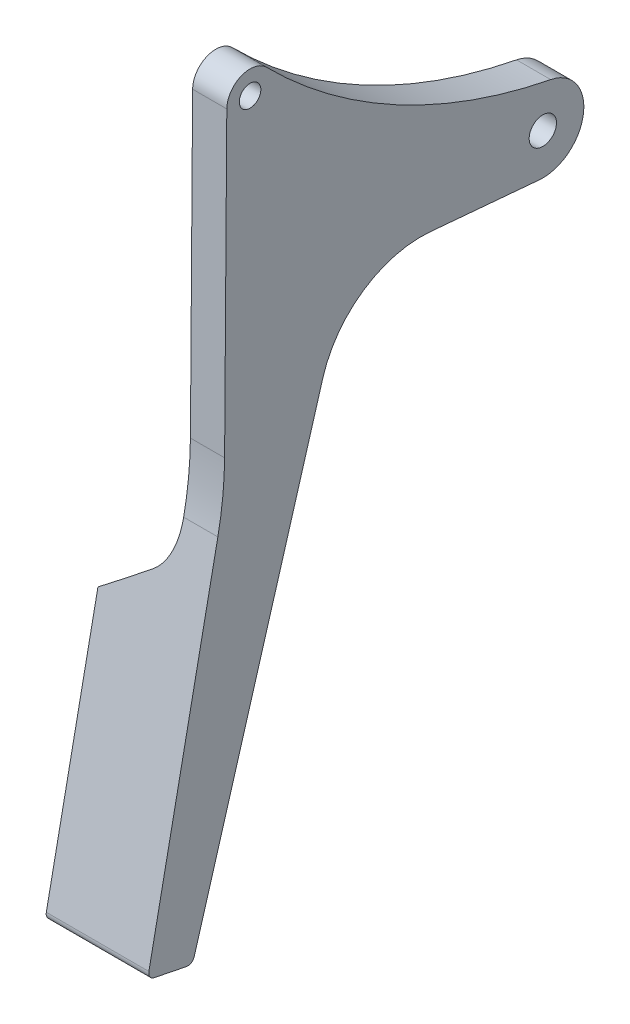
ISO-10303-21;
HEADER;
FILE_DESCRIPTION(('STEP AP214'),'2;1');
FILE_NAME('part.step','',(''),(''),'','','');
FILE_SCHEMA(('AUTOMOTIVE_DESIGN { 1 0 10303 214 1 1 1 1 }'));
ENDSEC;
DATA;
#1=APPLICATION_CONTEXT('core data for automotive mechanical design processes');
#2=APPLICATION_PROTOCOL_DEFINITION('international standard','automotive_design',2000,#1);
#3=PRODUCT_CONTEXT('',#1,'mechanical');
#4=PRODUCT('Part','Part','',(#3));
#5=PRODUCT_RELATED_PRODUCT_CATEGORY('part','',(#4));
#6=PRODUCT_DEFINITION_FORMATION('','',#4);
#7=PRODUCT_DEFINITION_CONTEXT('part definition',#1,'design');
#8=PRODUCT_DEFINITION('design','',#6,#7);
#9=PRODUCT_DEFINITION_SHAPE('','',#8);
#10=(LENGTH_UNIT() NAMED_UNIT(*) SI_UNIT(.MILLI.,.METRE.));
#11=(NAMED_UNIT(*) PLANE_ANGLE_UNIT() SI_UNIT($,.RADIAN.));
#12=(NAMED_UNIT(*) SI_UNIT($,.STERADIAN.) SOLID_ANGLE_UNIT());
#13=UNCERTAINTY_MEASURE_WITH_UNIT(LENGTH_MEASURE(1.E-05),#10,'distance_accuracy_value','');
#14=(GEOMETRIC_REPRESENTATION_CONTEXT(3) GLOBAL_UNCERTAINTY_ASSIGNED_CONTEXT((#13)) GLOBAL_UNIT_ASSIGNED_CONTEXT((#10,
#11,#12)) REPRESENTATION_CONTEXT('',''));
#15=CARTESIAN_POINT('',(0.,0.,0.));
#16=DIRECTION('',(0.,0.,1.));
#17=DIRECTION('',(1.,0.,0.));
#18=AXIS2_PLACEMENT_3D('',#15,#16,#17);
#19=CARTESIAN_POINT('',(158.962030866419,-137.598340552411,-33.4938597849691));
#20=DIRECTION('',(0.,0.282459573012157,0.959279203159221));
#21=DIRECTION('',(0.,-0.959279203159221,0.282459573012157));
#22=AXIS2_PLACEMENT_3D('',#19,#20,#21);
#23=PLANE('',#22);
#24=DIRECTION('',(0.,0.959279203159221,-0.282459573012157));
#25=VECTOR('',#24,1.);
#26=CARTESIAN_POINT('',(20.,-137.598340552411,-33.4938597849691));
#27=LINE('',#26,#25);
#28=CARTESIAN_POINT('',(20.,-129.015775162978,-36.0209944786688));
#29=VERTEX_POINT('',#28);
#30=CARTESIAN_POINT('',(20.,-65.1850920027316,-54.8159266018088));
#31=VERTEX_POINT('',#30);
#32=EDGE_CURVE('E293',#29,#31,#27,.T.);
#33=ORIENTED_EDGE('',*,*,#32,.F.);
#34=DIRECTION('',(1.,0.,0.));
#35=VECTOR('',#34,1.);
#36=CARTESIAN_POINT('',(158.962030866419,-129.015775162978,-36.0209944786688));
#37=LINE('',#36,#35);
#38=CARTESIAN_POINT('',(5.,-129.015775162978,-36.0209944786688));
#39=VERTEX_POINT('',#38);
#40=EDGE_CURVE('E60',#29,#39,#37,.F.);
#41=ORIENTED_EDGE('',*,*,#40,.T.);
#42=DIRECTION('',(0.,-0.959279203159221,0.282459573012157));
#43=VECTOR('',#42,1.);
#44=CARTESIAN_POINT('',(5.,-137.598340552411,-33.4938597849691));
#45=LINE('',#44,#43);
#46=CARTESIAN_POINT('',(5.,-98.5136821411292,-45.0023297797516));
#47=VERTEX_POINT('',#46);
#48=EDGE_CURVE('E167',#47,#39,#45,.T.);
#49=ORIENTED_EDGE('',*,*,#48,.F.);
#50=CARTESIAN_POINT('',(12.0002,-94.225863053771,-46.2648772680948));
#51=CARTESIAN_POINT('',(11.4181068308902,-94.5851016538781,-46.1590995328311));
#52=CARTESIAN_POINT('',(10.8356698756042,-94.9438274183706,-46.0534728019135));
#53=CARTESIAN_POINT('',(9.67014830951818,-95.6603061476602,-45.8425057807575));
#54=CARTESIAN_POINT('',(9.08706370047362,-96.0180591150849,-45.7371654897454));
#55=CARTESIAN_POINT('',(7.92028374249992,-96.7326469738212,-45.5267552350525));
#56=CARTESIAN_POINT('',(7.33658839372461,-97.0894818653638,-45.4216852713037));
#57=CARTESIAN_POINT('',(6.16861919214037,-97.8022827331318,-45.2118011957505));
#58=CARTESIAN_POINT('',(5.58434533777172,-98.1582487070053,-45.1069870846387));
#59=CARTESIAN_POINT('',(4.9998,-98.5138037927106,-45.0022939594673));
#60=B_SPLINE_CURVE_WITH_KNOTS('',3,(#50,#51,#52,#53,#54,#55,#56,#57,#58,#59),.UNSPECIFIED.,.F.,
.F.,(4,2,2,2,4),(0.,2.07645415499275,4.152902695728,6.22935071360871,8.30580434521774),.UNSPECIFIED.);
#61=CARTESIAN_POINT('',(12.,-94.2259864840353,-46.2648409240777));
#62=VERTEX_POINT('',#61);
#63=EDGE_CURVE('E166',#62,#47,#60,.T.);
#64=ORIENTED_EDGE('',*,*,#63,.F.);
#65=CARTESIAN_POINT('',(11.9998,-82.8210578346822,-49.6230199254791));
#66=CARTESIAN_POINT('',(12.15430459384,-82.9221876774031,-49.5932422631472));
#67=CARTESIAN_POINT('',(12.303724032,-83.030324075716,-49.561401521897));
#68=CARTESIAN_POINT('',(12.5916230267251,-83.2590322603663,-49.4940584418344));
#69=CARTESIAN_POINT('',(12.7301123642273,-83.3795927008879,-49.4585594437953));
#70=CARTESIAN_POINT('',(12.9950068854421,-83.6311360505902,-49.384492553867));
#71=CARTESIAN_POINT('',(13.1214684519462,-83.7620644583574,-49.3459407099082));
#72=CARTESIAN_POINT('',(13.3626681740416,-84.0334950336313,-49.2660180303152));
#73=CARTESIAN_POINT('',(13.4774036194469,-84.1739994019192,-49.2246465466614));
#74=CARTESIAN_POINT('',(13.8026889570887,-84.60689301851,-49.0971811062564));
#75=CARTESIAN_POINT('',(13.9954861067135,-84.9117891156579,-49.0074045103188));
#76=CARTESIAN_POINT('',(14.3317274927634,-85.5458893614363,-48.8206938174574));
#77=CARTESIAN_POINT('',(14.4750960285437,-85.8751298656586,-48.7237490156367));
#78=CARTESIAN_POINT('',(14.7251350926013,-86.5897429817325,-48.5133313239257));
#79=CARTESIAN_POINT('',(14.8254868876638,-86.9771572482292,-48.399257269226));
#80=CARTESIAN_POINT('',(14.961497245702,-87.7624621172597,-48.1680244047375));
#81=CARTESIAN_POINT('',(14.9971464855845,-88.1603542211831,-48.0508651528649));
#82=CARTESIAN_POINT('',(15.0012683437187,-88.7698981527664,-47.8713850618964));
#83=CARTESIAN_POINT('',(14.9933598944176,-88.9816268012067,-47.8090416029369));
#84=CARTESIAN_POINT('',(14.9587197840348,-89.4036396209142,-47.6847800110378));
#85=CARTESIAN_POINT('',(14.9319951131521,-89.6139242993296,-47.6228617287686));
#86=CARTESIAN_POINT('',(14.8595574177556,-90.0316438936498,-47.4998642762419));
#87=CARTESIAN_POINT('',(14.8138282604547,-90.2390762332947,-47.4387858645635));
#88=CARTESIAN_POINT('',(14.7033319592601,-90.6491316046192,-47.3180451409929));
#89=CARTESIAN_POINT('',(14.6385742356532,-90.8517569625283,-47.2583821441428));
#90=CARTESIAN_POINT('',(14.492228621175,-91.2445952089229,-47.1427109996271));
#91=CARTESIAN_POINT('',(14.4111953921699,-91.4349979692104,-47.0866469442468));
#92=CARTESIAN_POINT('',(14.2313903087825,-91.8078339793632,-46.9768654542651));
#93=CARTESIAN_POINT('',(14.1326275235328,-91.9902712447471,-46.9231468372951));
#94=CARTESIAN_POINT('',(13.9178017475281,-92.3451254816741,-46.8186600769089));
#95=CARTESIAN_POINT('',(13.801769529992,-92.5175595338758,-46.7678869040962));
#96=CARTESIAN_POINT('',(13.5528576994898,-92.850725171158,-46.6697863476167));
#97=CARTESIAN_POINT('',(13.419984167748,-93.0114609475479,-46.6224577298198));
#98=CARTESIAN_POINT('',(13.0925465783273,-93.3689692269932,-46.5171894871352));
#99=CARTESIAN_POINT('',(12.8918870754706,-93.5607023301862,-46.4607337125476));
#100=CARTESIAN_POINT('',(12.5715619087451,-93.8269340822958,-46.3823418254145));
#101=CARTESIAN_POINT('',(12.4614347543216,-93.9121971920322,-46.3572361194944));
#102=CARTESIAN_POINT('',(12.23508612833,-94.0750508991275,-46.3092838774171));
#103=CARTESIAN_POINT('',(12.1188612988083,-94.1526371995843,-46.2864386064819));
#104=CARTESIAN_POINT('',(11.9998,-94.2261099087566,-46.2648045816928));
#105=B_SPLINE_CURVE_WITH_KNOTS('',3,(#65,#66,#67,#68,#69,#70,#71,#72,#73,#74,#75,#76,#77,#78,
#79,#80,#81,#82,#83,#84,#85,#86,#87,#88,#89,#90,#91,#92,#93,#94,#95,#96,#97,#98,#99,#100,#101,
#102,#103,#104),.UNSPECIFIED.,.F.,.F.,(4,2,2,2,2,2,2,2,2,2,2,2,2,2,2,2,2,2,2,4),(0.,
0.56079926032494,1.12109085421803,1.67861111933887,2.2362599506535,3.3466462182285,
4.45872558202947,5.70190580097859,6.94526513750978,7.60716196303557,8.26881302450779,
8.93102690835336,9.59291350717973,10.2352162455361,10.8771913605936,11.5180359108483,
12.1586497145137,13.0053273599257,13.4295837325269,13.8540762444164),.UNSPECIFIED.);
#106=CARTESIAN_POINT('',(15.,-88.6066840713936,-47.9194434161089));
#107=VERTEX_POINT('',#106);
#108=EDGE_CURVE('E159',#107,#62,#105,.T.);
#109=ORIENTED_EDGE('',*,*,#108,.F.);
#110=DIRECTION('',(0.,-0.959279203159221,0.282459573012157));
#111=VECTOR('',#110,1.);
#112=CARTESIAN_POINT('',(15.,-53.4033261892142,-58.285065232205));
#113=LINE('',#112,#111);
#114=CARTESIAN_POINT('',(15.,-65.1850920027316,-54.8159266018088));
#115=VERTEX_POINT('',#114);
#116=EDGE_CURVE('E144',#115,#107,#113,.T.);
#117=ORIENTED_EDGE('',*,*,#116,.F.);
#118=DIRECTION('',(-1.,0.,0.));
#119=VECTOR('',#118,1.);
#120=CARTESIAN_POINT('',(20.,-65.1850920027316,-54.8159266018088));
#121=LINE('',#120,#119);
#122=EDGE_CURVE('E262',#115,#31,#121,.F.);
#123=ORIENTED_EDGE('',*,*,#122,.T.);
#124=EDGE_LOOP('',(#33,#41,#49,#64,#109,#117,#123));
#125=FACE_BOUND('',#124,.T.);
#126=ADVANCED_FACE('F37',(#125),#23,.F.);
#127=CARTESIAN_POINT('',(158.962030866419,-77.5968625232369,-39.4790610609905));
#128=DIRECTION('',(0.,-0.197778037606252,-0.98024683005895));
#129=DIRECTION('',(0.,0.98024683005895,-0.197778037606252));
#130=AXIS2_PLACEMENT_3D('',#127,#128,#129);
#131=PLANE('',#130);
#132=DIRECTION('',(0.,0.98024683005895,-0.197778037606252));
#133=VECTOR('',#132,1.);
#134=CARTESIAN_POINT('',(5.,-77.5968625232369,-39.4790610609905));
#135=LINE('',#134,#133);
#136=CARTESIAN_POINT('',(5.,-127.589450856243,-29.3923811430716));
#137=VERTEX_POINT('',#136);
#138=CARTESIAN_POINT('',(5.,-90.1654034922796,-36.9431881642819));
#139=VERTEX_POINT('',#138);
#140=EDGE_CURVE('E258',#137,#139,#135,.T.);
#141=ORIENTED_EDGE('',*,*,#140,.F.);
#142=DIRECTION('',(1.,0.,0.));
#143=VECTOR('',#142,1.);
#144=CARTESIAN_POINT('',(158.962030866419,-127.589450856243,-29.3923811430716));
#145=LINE('',#144,#143);
#146=CARTESIAN_POINT('',(20.,-127.589450856243,-29.3923811430716));
#147=VERTEX_POINT('',#146);
#148=EDGE_CURVE('E11',#137,#147,#145,.T.);
#149=ORIENTED_EDGE('',*,*,#148,.T.);
#150=DIRECTION('',(0.,-0.98024683005895,0.197778037606252));
#151=VECTOR('',#150,1.);
#152=CARTESIAN_POINT('',(20.,-77.5968625232369,-39.4790610609905));
#153=LINE('',#152,#151);
#154=CARTESIAN_POINT('',(20.,-77.5968625232369,-39.4790610609905));
#155=VERTEX_POINT('',#154);
#156=EDGE_CURVE('E295',#155,#147,#153,.T.);
#157=ORIENTED_EDGE('',*,*,#156,.F.);
#158=DIRECTION('',(-1.,0.,0.));
#159=VECTOR('',#158,1.);
#160=CARTESIAN_POINT('',(158.962030866419,-77.5968625232369,-39.4790610609905));
#161=LINE('',#160,#159);
#162=CARTESIAN_POINT('',(15.,-77.5968625232369,-39.4790610609905));
#163=VERTEX_POINT('',#162);
#164=EDGE_CURVE('E322',#155,#163,#161,.T.);
#165=ORIENTED_EDGE('',*,*,#164,.T.);
#166=CARTESIAN_POINT('',(10.0477170206096,-85.8341572682851,-37.8170755896761));
#167=CARTESIAN_POINT('',(10.1760522091918,-85.8039492038567,-37.8231704746778));
#168=CARTESIAN_POINT('',(10.3030103733954,-85.7682730305671,-37.830368624497));
#169=CARTESIAN_POINT('',(10.553397225375,-85.6866517194451,-37.8468368264289));
#170=CARTESIAN_POINT('',(10.6768272053135,-85.6407103969125,-37.8561061087535));
#171=CARTESIAN_POINT('',(10.918746861634,-85.5395087522913,-37.8765249074294));
#172=CARTESIAN_POINT('',(11.0372618436195,-85.4843063045308,-37.8876627468535));
#173=CARTESIAN_POINT('',(11.2695707323867,-85.3651344788264,-37.9117072722761));
#174=CARTESIAN_POINT('',(11.3833657099646,-85.3011671036521,-37.9246135541888));
#175=CARTESIAN_POINT('',(11.582039449859,-85.1797562665324,-37.9491098304055));
#176=CARTESIAN_POINT('',(11.6678978297567,-85.1238430771922,-37.9603910715428));
#177=CARTESIAN_POINT('',(11.8363378370368,-85.0074069244855,-37.9838836379889));
#178=CARTESIAN_POINT('',(11.9189181405588,-84.9468821269442,-37.9960953333673));
#179=CARTESIAN_POINT('',(12.1557311415426,-84.7634391736108,-38.033107426863));
#180=CARTESIAN_POINT('',(12.3053495894116,-84.6347373607704,-38.0590747559064));
#181=CARTESIAN_POINT('',(12.5915139579439,-84.363942774374,-38.1137112211818));
#182=CARTESIAN_POINT('',(12.7280480498831,-84.2218381101582,-38.142382756515));
#183=CARTESIAN_POINT('',(12.9883861964154,-83.9259255029901,-38.2020871217361));
#184=CARTESIAN_POINT('',(13.112140809486,-83.7720758383059,-38.2331283695469));
#185=CARTESIAN_POINT('',(13.3464743161514,-83.4551611820793,-38.2970701818284));
#186=CARTESIAN_POINT('',(13.4570549563716,-83.2920974163923,-38.3299704989662));
#187=CARTESIAN_POINT('',(13.830480835454,-82.6940033740638,-38.4506440501254));
#188=CARTESIAN_POINT('',(14.05743411425,-82.2368525081984,-38.542880411793));
#189=CARTESIAN_POINT('',(14.3394346890461,-81.5303117591492,-38.6854345507616));
#190=CARTESIAN_POINT('',(14.4237214994715,-81.2912164352319,-38.7336752616878));
#191=CARTESIAN_POINT('',(14.5740530272405,-80.807532948382,-38.8312649380003));
#192=CARTESIAN_POINT('',(14.6401001877119,-80.5629455258442,-38.8806137540018));
#193=CARTESIAN_POINT('',(14.8012075952494,-79.8709899961662,-39.020225127968));
#194=CARTESIAN_POINT('',(14.8766979615624,-79.4191916985316,-39.1113815367009));
#195=CARTESIAN_POINT('',(14.9760994172073,-78.5104404619223,-39.294734372678));
#196=CARTESIAN_POINT('',(15.0000120875869,-78.0534876813833,-39.3869307679556));
#197=CARTESIAN_POINT('',(14.999991525757,-77.2764946039944,-39.5436996157267));
#198=CARTESIAN_POINT('',(14.9882312857971,-76.9563893724732,-39.6082851696672));
#199=CARTESIAN_POINT('',(14.9420913294434,-76.3176651981818,-39.7371563987181));
#200=CARTESIAN_POINT('',(14.9077061175453,-75.9990466354574,-39.8014419971493));
#201=CARTESIAN_POINT('',(14.8169303738644,-75.3651217930159,-39.9293448961777));
#202=CARTESIAN_POINT('',(14.7605603217895,-75.0498127102949,-39.9929627623188));
#203=CARTESIAN_POINT('',(14.6596931947195,-74.5803329017979,-40.0876866546825));
#204=CARTESIAN_POINT('',(14.6233579964663,-74.4244405468655,-40.1191400428403));
#205=CARTESIAN_POINT('',(14.5452270349465,-74.1139731516157,-40.1817810331402));
#206=CARTESIAN_POINT('',(14.5034311560418,-73.9593981392688,-40.2129686296388));
#207=CARTESIAN_POINT('',(14.4588941412981,-73.805570288793,-40.2440054761385));
#208=B_SPLINE_CURVE_WITH_KNOTS('',3,(#166,#167,#168,#169,#170,#171,#172,#173,#174,#175,#176,
#177,#178,#179,#180,#181,#182,#183,#184,#185,#186,#187,#188,#189,#190,#191,#192,#193,#194,#195,
#196,#197,#198,#199,#200,#201,#202,#203,#204,#205,#206,#207),.UNSPECIFIED.,.F.,.F.,(4,2,2,2,2,2,
2,2,2,2,2,2,2,2,2,2,2,2,2,2,4),(0.,0.395773631612749,0.791400408015988,1.18464114251265,
1.57779217161512,1.88686659261617,2.19606458997815,2.79216360432342,3.38879652783818,
3.98765744799397,4.58643888169249,6.13255839184248,6.90631721046647,7.6799723368872,
9.07767084610103,10.4753265100596,11.4548796230336,12.4346707529421,13.4135513421184,
13.9028629156035,14.3921848526738),.UNSPECIFIED.);
#209=CARTESIAN_POINT('',(12.,-84.8840735114263,-38.0087678198686));
#210=VERTEX_POINT('',#209);
#211=EDGE_CURVE('E162',#210,#163,#208,.T.);
#212=ORIENTED_EDGE('',*,*,#211,.F.);
#213=CARTESIAN_POINT('',(4.9998,-90.1655507861382,-36.9431584457565));
#214=CARTESIAN_POINT('',(5.58837369639777,-89.7320789500074,-37.0306172433558));
#215=CARTESIAN_POINT('',(6.17578582321182,-89.2970888445926,-37.1183823722896));
#216=CARTESIAN_POINT('',(7.34806303944173,-88.4238679287305,-37.2945664861679));
#217=CARTESIAN_POINT('',(7.93292822289283,-87.985637239568,-37.3829854466415));
#218=CARTESIAN_POINT('',(9.09993371838689,-87.1056970808876,-37.5605252585114));
#219=CARTESIAN_POINT('',(9.68207402015716,-86.6639875982716,-37.6496461125504));
#220=CARTESIAN_POINT('',(10.843410423823,-85.7768221931088,-37.8286437154855));
#221=CARTESIAN_POINT('',(11.4226064152472,-85.3313661316297,-37.9185204924131));
#222=CARTESIAN_POINT('',(12.0002,-84.8839185737605,-38.0087990806353));
#223=B_SPLINE_CURVE_WITH_KNOTS('',3,(#213,#214,#215,#216,#217,#218,#219,#220,#221,#222),
.UNSPECIFIED.,.F.,.F.,(4,2,2,2,4),(0.,2.20854982588795,4.41701740697654,6.62549330719743,
8.83405146736047),.UNSPECIFIED.);
#224=EDGE_CURVE('E250',#139,#210,#223,.T.);
#225=ORIENTED_EDGE('',*,*,#224,.F.);
#226=EDGE_LOOP('',(#141,#149,#157,#165,#212,#225));
#227=FACE_BOUND('',#226,.T.);
#228=ADVANCED_FACE('F217',(#227),#131,.F.);
#229=CARTESIAN_POINT('',(158.962030866419,-68.0739253145423,-40.4653802386964));
#230=DIRECTION('',(0.,-0.00731929343235953,-0.99997321361307));
#231=DIRECTION('',(0.,0.99997321361307,-0.00731929343235953));
#232=AXIS2_PLACEMENT_3D('',#229,#230,#231);
#233=PLANE('',#232);
#234=DIRECTION('',(-1.,0.,0.));
#235=VECTOR('',#234,1.);
#236=CARTESIAN_POINT('',(158.962030866419,-24.0534621893285,-40.7875875561082));
#237=LINE('',#236,#235);
#238=CARTESIAN_POINT('',(20.,-24.0534621893285,-40.7875875561082));
#239=VERTEX_POINT('',#238);
#240=CARTESIAN_POINT('',(15.,-24.0534621893285,-40.7875875561082));
#241=VERTEX_POINT('',#240);
#242=EDGE_CURVE('E310',#239,#241,#237,.T.);
#243=ORIENTED_EDGE('',*,*,#242,.T.);
#244=DIRECTION('',(0.,0.99997321361307,-0.00731929343235969));
#245=VECTOR('',#244,1.);
#246=CARTESIAN_POINT('',(15.,-68.0739253145423,-40.4653802386964));
#247=LINE('',#246,#245);
#248=CARTESIAN_POINT('',(15.,-68.0739253145423,-40.4653802386964));
#249=VERTEX_POINT('',#248);
#250=EDGE_CURVE('E338',#249,#241,#247,.T.);
#251=ORIENTED_EDGE('',*,*,#250,.F.);
#252=DIRECTION('',(-1.,0.,0.));
#253=VECTOR('',#252,1.);
#254=CARTESIAN_POINT('',(158.962030866419,-68.0739253145423,-40.4653802386964));
#255=LINE('',#254,#253);
#256=CARTESIAN_POINT('',(20.,-68.0739253145423,-40.4653802386964));
#257=VERTEX_POINT('',#256);
#258=EDGE_CURVE('E307',#257,#249,#255,.T.);
#259=ORIENTED_EDGE('',*,*,#258,.F.);
#260=DIRECTION('',(0.,-0.99997321361307,0.00731929343235953));
#261=VECTOR('',#260,1.);
#262=CARTESIAN_POINT('',(20.,-68.0739253145423,-40.4653802386964));
#263=LINE('',#262,#261);
#264=EDGE_CURVE('E349',#239,#257,#263,.T.);
#265=ORIENTED_EDGE('',*,*,#264,.F.);
#266=EDGE_LOOP('',(#243,#251,#259,#265));
#267=FACE_BOUND('',#266,.T.);
#268=ADVANCED_FACE('F213',(#267),#233,.F.);
#269=CARTESIAN_POINT('',(158.962030866419,-24.0783477869985,-44.1874964823926));
#270=DIRECTION('',(-1.,0.,0.));
#271=DIRECTION('',(0.,0.,1.));
#272=AXIS2_PLACEMENT_3D('',#269,#270,#271);
#273=CYLINDRICAL_SURFACE('',#272,3.4);
#274=DIRECTION('',(-1.,0.,0.));
#275=VECTOR('',#274,1.);
#276=CARTESIAN_POINT('',(158.962030866419,-21.6909838012307,-46.6083420370406));
#277=LINE('',#276,#275);
#278=CARTESIAN_POINT('',(20.,-21.6909838012307,-46.6083420370406));
#279=VERTEX_POINT('',#278);
#280=CARTESIAN_POINT('',(15.,-21.6909838012308,-46.6083420370406));
#281=VERTEX_POINT('',#280);
#282=EDGE_CURVE('E313',#279,#281,#277,.T.);
#283=ORIENTED_EDGE('',*,*,#282,.T.);
#284=CARTESIAN_POINT('',(15.,-24.0783477869985,-44.1874964823926));
#285=DIRECTION('',(1.,0.,0.));
#286=DIRECTION('',(0.,0.,-1.));
#287=AXIS2_PLACEMENT_3D('',#284,#285,#286);
#288=CIRCLE('',#287,3.4);
#289=EDGE_CURVE('E345',#241,#281,#288,.F.);
#290=ORIENTED_EDGE('',*,*,#289,.F.);
#291=ORIENTED_EDGE('',*,*,#242,.F.);
#292=CARTESIAN_POINT('',(20.,-24.0783477869985,-44.1874964823926));
#293=DIRECTION('',(1.,0.,0.));
#294=DIRECTION('',(0.,0.,-1.));
#295=AXIS2_PLACEMENT_3D('',#292,#293,#294);
#296=CIRCLE('',#295,3.4);
#297=EDGE_CURVE('E352',#279,#239,#296,.T.);
#298=ORIENTED_EDGE('',*,*,#297,.F.);
#299=EDGE_LOOP('',(#283,#290,#291,#298));
#300=FACE_BOUND('',#299,.T.);
#301=ADVANCED_FACE('F216',(#300),#273,.T.);
#302=CARTESIAN_POINT('',(158.962030866419,34.4822864521288,-103.569413911111));
#303=DIRECTION('',(-1.,0.,0.));
#304=DIRECTION('',(0.,0.,1.));
#305=AXIS2_PLACEMENT_3D('',#302,#303,#304);
#306=CYLINDRICAL_SURFACE('',#305,80.);
#307=DIRECTION('',(-1.,0.,0.));
#308=VECTOR('',#307,1.);
#309=CARTESIAN_POINT('',(158.962030866419,-44.0188399404529,-88.1560056217054));
#310=LINE('',#309,#308);
#311=CARTESIAN_POINT('',(20.,-44.0188399404529,-88.1560056217054));
#312=VERTEX_POINT('',#311);
#313=CARTESIAN_POINT('',(15.,-44.0188399404529,-88.1560056217055));
#314=VERTEX_POINT('',#313);
#315=EDGE_CURVE('E316',#312,#314,#310,.T.);
#316=ORIENTED_EDGE('',*,*,#315,.T.);
#317=CARTESIAN_POINT('',(15.,34.4822864521288,-103.569413911111));
#318=DIRECTION('',(1.,0.,0.));
#319=DIRECTION('',(0.,0.,-1.));
#320=AXIS2_PLACEMENT_3D('',#317,#318,#319);
#321=CIRCLE('',#320,80.);
#322=EDGE_CURVE('E343',#281,#314,#321,.T.);
#323=ORIENTED_EDGE('',*,*,#322,.F.);
#324=ORIENTED_EDGE('',*,*,#282,.F.);
#325=CARTESIAN_POINT('',(20.,34.4822864521288,-103.569413911111));
#326=DIRECTION('',(1.,0.,0.));
#327=DIRECTION('',(0.,0.,-1.));
#328=AXIS2_PLACEMENT_3D('',#325,#326,#327);
#329=CIRCLE('',#328,80.);
#330=EDGE_CURVE('E355',#312,#279,#329,.F.);
#331=ORIENTED_EDGE('',*,*,#330,.F.);
#332=EDGE_LOOP('',(#316,#323,#324,#331));
#333=FACE_BOUND('',#332,.T.);
#334=ADVANCED_FACE('F221',(#333),#306,.F.);
#335=CARTESIAN_POINT('',(158.962030866419,-49.9064244198965,-87.));
#336=DIRECTION('',(-1.,0.,0.));
#337=DIRECTION('',(0.,0.,1.));
#338=AXIS2_PLACEMENT_3D('',#335,#336,#337);
#339=CYLINDRICAL_SURFACE('',#338,6.);
#340=DIRECTION('',(-1.,0.,0.));
#341=VECTOR('',#340,1.);
#342=CARTESIAN_POINT('',(158.962030866419,-55.8833381279761,-86.4741649249333));
#343=LINE('',#342,#341);
#344=CARTESIAN_POINT('',(20.,-55.8833381279761,-86.4741649249333));
#345=VERTEX_POINT('',#344);
#346=CARTESIAN_POINT('',(15.,-55.8833381279761,-86.4741649249333));
#347=VERTEX_POINT('',#346);
#348=EDGE_CURVE('E319',#345,#347,#343,.T.);
#349=ORIENTED_EDGE('',*,*,#348,.T.);
#350=CARTESIAN_POINT('',(15.,-49.9064244198965,-87.));
#351=DIRECTION('',(1.,0.,0.));
#352=DIRECTION('',(0.,0.,-1.));
#353=AXIS2_PLACEMENT_3D('',#350,#351,#352);
#354=CIRCLE('',#353,6.);
#355=EDGE_CURVE('E341',#314,#347,#354,.F.);
#356=ORIENTED_EDGE('',*,*,#355,.F.);
#357=ORIENTED_EDGE('',*,*,#315,.F.);
#358=CARTESIAN_POINT('',(20.,-49.9064244198965,-87.));
#359=DIRECTION('',(1.,0.,0.));
#360=DIRECTION('',(0.,0.,-1.));
#361=AXIS2_PLACEMENT_3D('',#358,#359,#360);
#362=CIRCLE('',#361,6.);
#363=EDGE_CURVE('E301',#345,#312,#362,.T.);
#364=ORIENTED_EDGE('',*,*,#363,.F.);
#365=EDGE_LOOP('',(#349,#356,#357,#364));
#366=FACE_BOUND('',#365,.T.);
#367=ADVANCED_FACE('F225',(#366),#339,.T.);
#368=CARTESIAN_POINT('',(158.962030866419,-55.8833381279761,-86.4741649249333));
#369=DIRECTION('',(0.,0.996152284679931,-0.087639179177776));
#370=DIRECTION('',(0.,0.087639179177776,0.996152284679931));
#371=AXIS2_PLACEMENT_3D('',#368,#369,#370);
#372=PLANE('',#371);
#373=DIRECTION('',(0.,-0.087639179177776,-0.996152284679931));
#374=VECTOR('',#373,1.);
#375=CARTESIAN_POINT('',(20.,-55.8833381279761,-86.4741649249333));
#376=LINE('',#375,#374);
#377=CARTESIAN_POINT('',(20.,-54.479701327715,-70.5197023368638));
#378=VERTEX_POINT('',#377);
#379=EDGE_CURVE('E296',#378,#345,#376,.T.);
#380=ORIENTED_EDGE('',*,*,#379,.F.);
#381=DIRECTION('',(-1.,0.,0.));
#382=VECTOR('',#381,1.);
#383=CARTESIAN_POINT('',(15.,-54.479701327715,-70.5197023368638));
#384=LINE('',#383,#382);
#385=CARTESIAN_POINT('',(15.,-54.479701327715,-70.5197023368638));
#386=VERTEX_POINT('',#385);
#387=EDGE_CURVE('E257',#378,#386,#384,.T.);
#388=ORIENTED_EDGE('',*,*,#387,.T.);
#389=DIRECTION('',(0.,0.087639179177776,0.996152284679931));
#390=VECTOR('',#389,1.);
#391=CARTESIAN_POINT('',(15.,-55.8833381279761,-86.4741649249333));
#392=LINE('',#391,#390);
#393=EDGE_CURVE('E154',#347,#386,#392,.T.);
#394=ORIENTED_EDGE('',*,*,#393,.F.);
#395=ORIENTED_EDGE('',*,*,#348,.F.);
#396=EDGE_LOOP('',(#380,#388,#394,#395));
#397=FACE_BOUND('',#396,.T.);
#398=ADVANCED_FACE('F228',(#397),#372,.F.);
#399=CARTESIAN_POINT('',(158.962030866419,-67.7079606429244,9.53328044195705));
#400=DIRECTION('',(-1.,0.,0.));
#401=DIRECTION('',(0.,0.,1.));
#402=AXIS2_PLACEMENT_3D('',#399,#400,#401);
#403=CYLINDRICAL_SURFACE('',#402,50.);
#404=ORIENTED_EDGE('',*,*,#258,.T.);
#405=CARTESIAN_POINT('',(15.,-67.7079606429244,9.53328044195705));
#406=DIRECTION('',(1.,0.,0.));
#407=DIRECTION('',(0.,0.,-1.));
#408=AXIS2_PLACEMENT_3D('',#405,#406,#407);
#409=CIRCLE('',#408,50.);
#410=EDGE_CURVE('E163',#163,#249,#409,.T.);
#411=ORIENTED_EDGE('',*,*,#410,.F.);
#412=ORIENTED_EDGE('',*,*,#164,.F.);
#413=CARTESIAN_POINT('',(20.,-67.7079606429244,9.53328044195705));
#414=DIRECTION('',(1.,0.,0.));
#415=DIRECTION('',(0.,0.,-1.));
#416=AXIS2_PLACEMENT_3D('',#413,#414,#415);
#417=CIRCLE('',#416,50.);
#418=EDGE_CURVE('E299',#257,#155,#417,.F.);
#419=ORIENTED_EDGE('',*,*,#418,.F.);
#420=EDGE_LOOP('',(#404,#411,#412,#419));
#421=FACE_BOUND('',#420,.T.);
#422=ADVANCED_FACE('F211',(#421),#403,.F.);
#423=CARTESIAN_POINT('',(158.962030866419,-24.0783477869985,-44.1874964823926));
#424=DIRECTION('',(-1.,0.,0.));
#425=DIRECTION('',(0.,0.,1.));
#426=AXIS2_PLACEMENT_3D('',#423,#424,#425);
#427=CYLINDRICAL_SURFACE('',#426,1.575);
#428=CARTESIAN_POINT('',(15.,-24.0783477869985,-44.1874964823926));
#429=DIRECTION('',(1.,0.,0.));
#430=DIRECTION('',(0.,0.,-1.));
#431=AXIS2_PLACEMENT_3D('',#428,#429,#430);
#432=CIRCLE('',#431,1.575);
#433=CARTESIAN_POINT('',(15.,-24.0783477869985,-45.7624964823926));
#434=VERTEX_POINT('',#433);
#435=EDGE_CURVE('E328',#434,#434,#432,.T.);
#436=ORIENTED_EDGE('',*,*,#435,.F.);
#437=EDGE_LOOP('',(#436));
#438=FACE_BOUND('',#437,.T.);
#439=CARTESIAN_POINT('',(20.,-24.0783477869985,-44.1874964823926));
#440=DIRECTION('',(1.,0.,0.));
#441=DIRECTION('',(0.,0.,-1.));
#442=AXIS2_PLACEMENT_3D('',#439,#440,#441);
#443=CIRCLE('',#442,1.575);
#444=CARTESIAN_POINT('',(20.,-24.0783477869985,-45.7624964823926));
#445=VERTEX_POINT('',#444);
#446=EDGE_CURVE('E327',#445,#445,#443,.T.);
#447=ORIENTED_EDGE('',*,*,#446,.T.);
#448=EDGE_LOOP('',(#447));
#449=FACE_BOUND('',#448,.T.);
#450=ADVANCED_FACE('F207',(#438,#449),#427,.F.);
#451=CARTESIAN_POINT('',(158.962030866419,-49.9064244198965,-87.));
#452=DIRECTION('',(-1.,0.,0.));
#453=DIRECTION('',(0.,0.,1.));
#454=AXIS2_PLACEMENT_3D('',#451,#452,#453);
#455=CYLINDRICAL_SURFACE('',#454,2.);
#456=CARTESIAN_POINT('',(15.,-49.9064244198965,-87.));
#457=DIRECTION('',(1.,0.,0.));
#458=DIRECTION('',(0.,0.,-1.));
#459=AXIS2_PLACEMENT_3D('',#456,#457,#458);
#460=CIRCLE('',#459,2.);
#461=CARTESIAN_POINT('',(15.,-49.9064244198965,-89.));
#462=VERTEX_POINT('',#461);
#463=EDGE_CURVE('E329',#462,#462,#460,.T.);
#464=ORIENTED_EDGE('',*,*,#463,.F.);
#465=EDGE_LOOP('',(#464));
#466=FACE_BOUND('',#465,.T.);
#467=CARTESIAN_POINT('',(20.,-49.9064244198965,-87.));
#468=DIRECTION('',(1.,0.,0.));
#469=DIRECTION('',(0.,0.,-1.));
#470=AXIS2_PLACEMENT_3D('',#467,#468,#469);
#471=CIRCLE('',#470,2.);
#472=CARTESIAN_POINT('',(20.,-49.9064244198965,-89.));
#473=VERTEX_POINT('',#472);
#474=EDGE_CURVE('E325',#473,#473,#471,.T.);
#475=ORIENTED_EDGE('',*,*,#474,.T.);
#476=EDGE_LOOP('',(#475));
#477=FACE_BOUND('',#476,.T.);
#478=ADVANCED_FACE('F203',(#466,#477),#455,.F.);
#479=CARTESIAN_POINT('',(20.,-42.7343691654933,-38.9249991557742));
#480=DIRECTION('',(1.,0.,0.));
#481=DIRECTION('',(0.,0.,-1.));
#482=AXIS2_PLACEMENT_3D('',#479,#480,#481);
#483=PLANE('',#482);
#484=DIRECTION('',(0.,0.197778037606245,0.980246830058951));
#485=VECTOR('',#484,1.);
#486=CARTESIAN_POINT('',(20.,-128.569697686302,-29.1946031054654));
#487=LINE('',#486,#485);
#488=CARTESIAN_POINT('',(20.,-129.713562420025,-34.8639372379034));
#489=VERTEX_POINT('',#488);
#490=CARTESIAN_POINT('',(20.,-128.767475723909,-30.1748499355243));
#491=VERTEX_POINT('',#490);
#492=EDGE_CURVE('E289',#489,#491,#487,.T.);
#493=ORIENTED_EDGE('',*,*,#492,.F.);
#494=CARTESIAN_POINT('',(20.,-128.733315589966,-35.0617152755096));
#495=DIRECTION('',(1.,0.,0.));
#496=DIRECTION('',(0.,0.,-1.));
#497=AXIS2_PLACEMENT_3D('',#494,#495,#496);
#498=CIRCLE('',#497,1.);
#499=EDGE_CURVE('E274',#489,#29,#498,.T.);
#500=ORIENTED_EDGE('',*,*,#499,.T.);
#501=ORIENTED_EDGE('',*,*,#32,.T.);
#502=CARTESIAN_POINT('',(20.,-69.4219855979139,-69.2051146491972));
#503=DIRECTION('',(1.,0.,0.));
#504=DIRECTION('',(0.,0.,-1.));
#505=AXIS2_PLACEMENT_3D('',#502,#503,#504);
#506=CIRCLE('',#505,15.);
#507=EDGE_CURVE('E265',#31,#378,#506,.F.);
#508=ORIENTED_EDGE('',*,*,#507,.T.);
#509=ORIENTED_EDGE('',*,*,#379,.T.);
#510=ORIENTED_EDGE('',*,*,#363,.T.);
#511=ORIENTED_EDGE('',*,*,#330,.T.);
#512=ORIENTED_EDGE('',*,*,#297,.T.);
#513=ORIENTED_EDGE('',*,*,#264,.T.);
#514=ORIENTED_EDGE('',*,*,#418,.T.);
#515=ORIENTED_EDGE('',*,*,#156,.T.);
#516=CARTESIAN_POINT('',(20.,-127.78722889385,-30.3726279731306));
#517=DIRECTION('',(1.,0.,0.));
#518=DIRECTION('',(0.,0.,-1.));
#519=AXIS2_PLACEMENT_3D('',#516,#517,#518);
#520=CIRCLE('',#519,1.);
#521=EDGE_CURVE('E272',#147,#491,#520,.T.);
#522=ORIENTED_EDGE('',*,*,#521,.T.);
#523=EDGE_LOOP('',(#493,#500,#501,#508,#509,#510,#511,#512,#513,#514,#515,#522));
#524=FACE_BOUND('',#523,.T.);
#525=ORIENTED_EDGE('',*,*,#474,.F.);
#526=EDGE_LOOP('',(#525));
#527=FACE_BOUND('',#526,.T.);
#528=ORIENTED_EDGE('',*,*,#446,.F.);
#529=EDGE_LOOP('',(#528));
#530=FACE_BOUND('',#529,.T.);
#531=ADVANCED_FACE('F199',(#524,#527,#530),#483,.T.);
#532=CARTESIAN_POINT('',(15.,-42.7343691654933,-38.9249991557742));
#533=DIRECTION('',(1.,0.,0.));
#534=DIRECTION('',(0.,0.,-1.));
#535=AXIS2_PLACEMENT_3D('',#532,#533,#534);
#536=PLANE('',#535);
#537=ORIENTED_EDGE('',*,*,#435,.T.);
#538=EDGE_LOOP('',(#537));
#539=FACE_BOUND('',#538,.T.);
#540=ORIENTED_EDGE('',*,*,#463,.T.);
#541=EDGE_LOOP('',(#540));
#542=FACE_BOUND('',#541,.T.);
#543=ORIENTED_EDGE('',*,*,#410,.T.);
#544=ORIENTED_EDGE('',*,*,#250,.T.);
#545=ORIENTED_EDGE('',*,*,#289,.T.);
#546=ORIENTED_EDGE('',*,*,#322,.T.);
#547=ORIENTED_EDGE('',*,*,#355,.T.);
#548=ORIENTED_EDGE('',*,*,#393,.T.);
#549=CARTESIAN_POINT('',(15.,-69.4219855979139,-69.2051146491972));
#550=DIRECTION('',(1.,0.,0.));
#551=DIRECTION('',(0.,0.,-1.));
#552=AXIS2_PLACEMENT_3D('',#549,#550,#551);
#553=CIRCLE('',#552,15.);
#554=EDGE_CURVE('E150',#386,#115,#553,.T.);
#555=ORIENTED_EDGE('',*,*,#554,.T.);
#556=ORIENTED_EDGE('',*,*,#116,.T.);
#557=CARTESIAN_POINT('',(15.,-49.9064244198965,-87.));
#558=DIRECTION('',(1.,0.,0.));
#559=DIRECTION('',(0.,0.,-1.));
#560=AXIS2_PLACEMENT_3D('',#557,#558,#559);
#561=CIRCLE('',#560,55.);
#562=EDGE_CURVE('E147',#107,#163,#561,.F.);
#563=ORIENTED_EDGE('',*,*,#562,.T.);
#564=EDGE_LOOP('',(#543,#544,#545,#546,#547,#548,#555,#556,#563));
#565=FACE_BOUND('',#564,.T.);
#566=ADVANCED_FACE('F146',(#539,#542,#565),#536,.F.);
#567=CARTESIAN_POINT('',(5.,-49.9064244198965,-87.));
#568=DIRECTION('',(-1.,0.,0.));
#569=DIRECTION('',(0.,0.,1.));
#570=AXIS2_PLACEMENT_3D('',#567,#568,#569);
#571=CONICAL_SURFACE('',#570,64.237604307034,0.523598775598297);
#572=ORIENTED_EDGE('',*,*,#63,.T.);
#573=CARTESIAN_POINT('',(5.,-49.9064244198965,-87.));
#574=DIRECTION('',(1.,0.,0.));
#575=DIRECTION('',(0.,0.,-1.));
#576=AXIS2_PLACEMENT_3D('',#573,#574,#575);
#577=CIRCLE('',#576,64.237604307034);
#578=EDGE_CURVE('E288',#139,#47,#577,.T.);
#579=ORIENTED_EDGE('',*,*,#578,.F.);
#580=ORIENTED_EDGE('',*,*,#224,.T.);
#581=CARTESIAN_POINT('',(12.,-49.9064244198965,-87.));
#582=DIRECTION('',(1.,0.,0.));
#583=DIRECTION('',(0.,0.,-1.));
#584=AXIS2_PLACEMENT_3D('',#581,#582,#583);
#585=CIRCLE('',#584,60.1961524227067);
#586=EDGE_CURVE('E170',#210,#62,#585,.T.);
#587=ORIENTED_EDGE('',*,*,#586,.T.);
#588=EDGE_LOOP('',(#572,#579,#580,#587));
#589=FACE_BOUND('',#588,.T.);
#590=ADVANCED_FACE('F193',(#589),#571,.F.);
#591=CARTESIAN_POINT('',(5.,-114.144028726931,-87.));
#592=DIRECTION('',(-1.,0.,0.));
#593=DIRECTION('',(0.,0.,1.));
#594=AXIS2_PLACEMENT_3D('',#591,#592,#593);
#595=PLANE('',#594);
#596=ORIENTED_EDGE('',*,*,#48,.T.);
#597=CARTESIAN_POINT('',(5.,-128.733315589966,-35.0617152755096));
#598=DIRECTION('',(-1.,0.,0.));
#599=DIRECTION('',(0.,0.,1.));
#600=AXIS2_PLACEMENT_3D('',#597,#598,#599);
#601=CIRCLE('',#600,1.);
#602=CARTESIAN_POINT('',(5.,-129.713562420025,-34.8639372379034));
#603=VERTEX_POINT('',#602);
#604=EDGE_CURVE('E45',#39,#603,#601,.T.);
#605=ORIENTED_EDGE('',*,*,#604,.T.);
#606=DIRECTION('',(0.,0.197778037606245,0.980246830058951));
#607=VECTOR('',#606,1.);
#608=CARTESIAN_POINT('',(5.,-128.569697686302,-29.1946031054654));
#609=LINE('',#608,#607);
#610=CARTESIAN_POINT('',(5.,-128.767475723909,-30.1748499355243));
#611=VERTEX_POINT('',#610);
#612=EDGE_CURVE('E279',#603,#611,#609,.T.);
#613=ORIENTED_EDGE('',*,*,#612,.T.);
#614=CARTESIAN_POINT('',(5.,-127.78722889385,-30.3726279731306));
#615=DIRECTION('',(-1.,0.,0.));
#616=DIRECTION('',(0.,0.,1.));
#617=AXIS2_PLACEMENT_3D('',#614,#615,#616);
#618=CIRCLE('',#617,1.);
#619=EDGE_CURVE('E52',#611,#137,#618,.T.);
#620=ORIENTED_EDGE('',*,*,#619,.T.);
#621=ORIENTED_EDGE('',*,*,#140,.T.);
#622=ORIENTED_EDGE('',*,*,#578,.T.);
#623=EDGE_LOOP('',(#596,#605,#613,#620,#621,#622));
#624=FACE_BOUND('',#623,.T.);
#625=ADVANCED_FACE('F192',(#624),#595,.T.);
#626=CARTESIAN_POINT('',(9.,-49.9064244198965,-87.));
#627=DIRECTION('',(1.,0.,0.));
#628=DIRECTION('',(0.,0.,-1.));
#629=AXIS2_PLACEMENT_3D('',#626,#627,#628);
#630=TOROIDAL_SURFACE('',#629,55.,6.);
#631=ORIENTED_EDGE('',*,*,#108,.T.);
#632=ORIENTED_EDGE('',*,*,#586,.F.);
#633=ORIENTED_EDGE('',*,*,#211,.T.);
#634=ORIENTED_EDGE('',*,*,#562,.F.);
#635=EDGE_LOOP('',(#631,#632,#633,#634));
#636=FACE_BOUND('',#635,.T.);
#637=ADVANCED_FACE('F157',(#636),#630,.F.);
#638=CARTESIAN_POINT('',(158.962030866419,-69.4219855979139,-69.2051146491972));
#639=DIRECTION('',(1.,0.,0.));
#640=DIRECTION('',(0.,0.,-1.));
#641=AXIS2_PLACEMENT_3D('',#638,#639,#640);
#642=CYLINDRICAL_SURFACE('',#641,15.);
#643=ORIENTED_EDGE('',*,*,#507,.F.);
#644=ORIENTED_EDGE('',*,*,#122,.F.);
#645=ORIENTED_EDGE('',*,*,#554,.F.);
#646=ORIENTED_EDGE('',*,*,#387,.F.);
#647=EDGE_LOOP('',(#643,#644,#645,#646));
#648=FACE_BOUND('',#647,.T.);
#649=ADVANCED_FACE('F191',(#648),#642,.F.);
#650=CARTESIAN_POINT('',(-6.92374338271546,-128.569697686302,-29.1946031054654));
#651=DIRECTION('',(0.,0.980246830058951,-0.197778037606245));
#652=DIRECTION('',(0.,0.197778037606245,0.980246830058951));
#653=AXIS2_PLACEMENT_3D('',#650,#651,#652);
#654=PLANE('',#653);
#655=ORIENTED_EDGE('',*,*,#612,.F.);
#656=DIRECTION('',(1.,0.,0.));
#657=VECTOR('',#656,1.);
#658=CARTESIAN_POINT('',(-6.92374338271546,-129.713562420025,-34.8639372379034));
#659=LINE('',#658,#657);
#660=EDGE_CURVE('E269',#603,#489,#659,.T.);
#661=ORIENTED_EDGE('',*,*,#660,.T.);
#662=ORIENTED_EDGE('',*,*,#492,.T.);
#663=DIRECTION('',(1.,0.,0.));
#664=VECTOR('',#663,1.);
#665=CARTESIAN_POINT('',(-6.92374338271546,-128.767475723909,-30.1748499355243));
#666=LINE('',#665,#664);
#667=EDGE_CURVE('E267',#491,#611,#666,.F.);
#668=ORIENTED_EDGE('',*,*,#667,.T.);
#669=EDGE_LOOP('',(#655,#661,#662,#668));
#670=FACE_BOUND('',#669,.T.);
#671=ADVANCED_FACE('F284',(#670),#654,.F.);
#672=CARTESIAN_POINT('',(-6.92374338271546,-128.733315589966,-35.0617152755096));
#673=DIRECTION('',(1.,0.,0.));
#674=DIRECTION('',(0.,0.,-1.));
#675=AXIS2_PLACEMENT_3D('',#672,#673,#674);
#676=CYLINDRICAL_SURFACE('',#675,1.);
#677=ORIENTED_EDGE('',*,*,#604,.F.);
#678=ORIENTED_EDGE('',*,*,#40,.F.);
#679=ORIENTED_EDGE('',*,*,#499,.F.);
#680=ORIENTED_EDGE('',*,*,#660,.F.);
#681=EDGE_LOOP('',(#677,#678,#679,#680));
#682=FACE_BOUND('',#681,.T.);
#683=ADVANCED_FACE('F291',(#682),#676,.T.);
#684=CARTESIAN_POINT('',(158.962030866419,-127.78722889385,-30.3726279731306));
#685=DIRECTION('',(1.,0.,0.));
#686=DIRECTION('',(0.,0.,-1.));
#687=AXIS2_PLACEMENT_3D('',#684,#685,#686);
#688=CYLINDRICAL_SURFACE('',#687,1.);
#689=ORIENTED_EDGE('',*,*,#619,.F.);
#690=ORIENTED_EDGE('',*,*,#667,.F.);
#691=ORIENTED_EDGE('',*,*,#521,.F.);
#692=ORIENTED_EDGE('',*,*,#148,.F.);
#693=EDGE_LOOP('',(#689,#690,#691,#692));
#694=FACE_BOUND('',#693,.T.);
#695=ADVANCED_FACE('F39',(#694),#688,.T.);
#696=CLOSED_SHELL('',(#126,#228,#268,#301,#334,#367,#398,#422,#450,#478,#531,#566,#590,#625,
#637,#649,#671,#683,#695));
#697=MANIFOLD_SOLID_BREP('B2',#696);
#698=ADVANCED_BREP_SHAPE_REPRESENTATION('',(#18,#697),#14);
#699=SHAPE_DEFINITION_REPRESENTATION(#9,#698);
ENDSEC;
END-ISO-10303-21;
